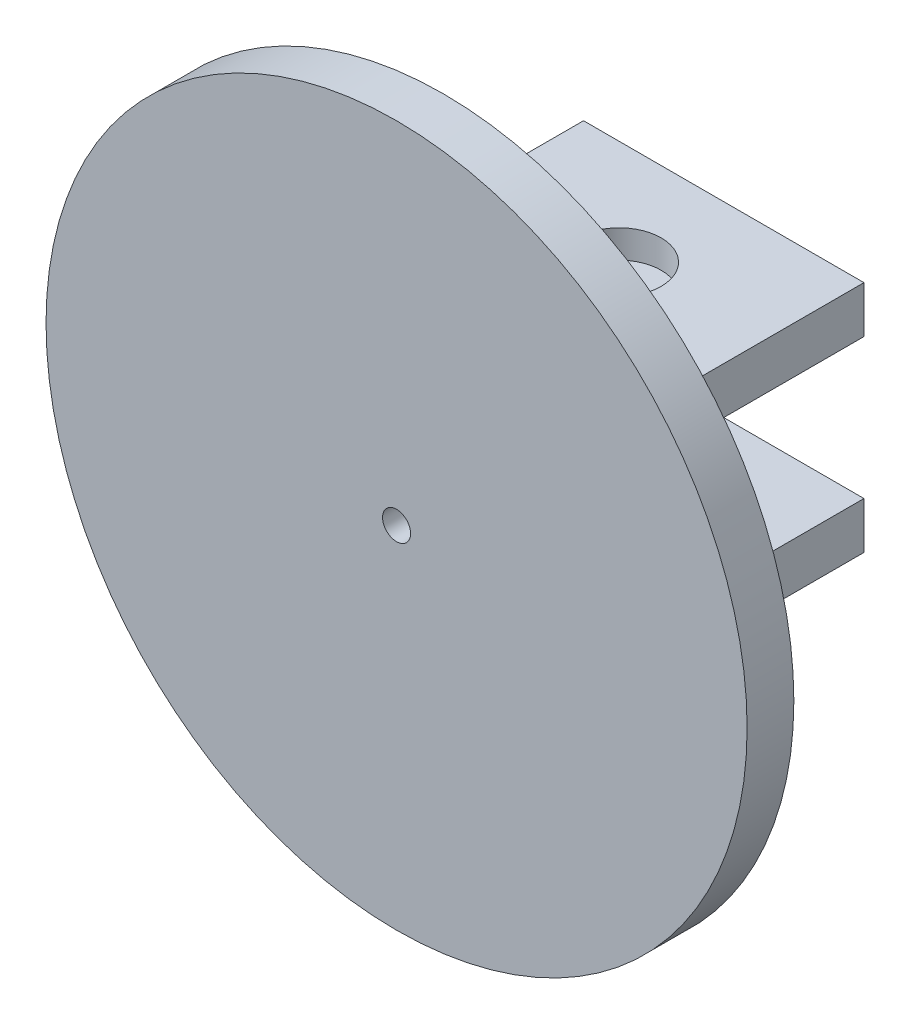
ISO-10303-21;
HEADER;
FILE_DESCRIPTION(('STEP AP214'),'2;1');
FILE_NAME('part.step','',(''),(''),'','','');
FILE_SCHEMA(('AUTOMOTIVE_DESIGN { 1 0 10303 214 1 1 1 1 }'));
ENDSEC;
DATA;
#1=APPLICATION_CONTEXT('core data for automotive mechanical design processes');
#2=APPLICATION_PROTOCOL_DEFINITION('international standard','automotive_design',2000,#1);
#3=PRODUCT_CONTEXT('',#1,'mechanical');
#4=PRODUCT('Part','Part','',(#3));
#5=PRODUCT_RELATED_PRODUCT_CATEGORY('part','',(#4));
#6=PRODUCT_DEFINITION_FORMATION('','',#4);
#7=PRODUCT_DEFINITION_CONTEXT('part definition',#1,'design');
#8=PRODUCT_DEFINITION('design','',#6,#7);
#9=PRODUCT_DEFINITION_SHAPE('','',#8);
#10=(LENGTH_UNIT() NAMED_UNIT(*) SI_UNIT(.MILLI.,.METRE.));
#11=(NAMED_UNIT(*) PLANE_ANGLE_UNIT() SI_UNIT($,.RADIAN.));
#12=(NAMED_UNIT(*) SI_UNIT($,.STERADIAN.) SOLID_ANGLE_UNIT());
#13=UNCERTAINTY_MEASURE_WITH_UNIT(LENGTH_MEASURE(1.E-05),#10,'distance_accuracy_value','');
#14=(GEOMETRIC_REPRESENTATION_CONTEXT(3) GLOBAL_UNCERTAINTY_ASSIGNED_CONTEXT((#13)) GLOBAL_UNIT_ASSIGNED_CONTEXT((#10,
#11,#12)) REPRESENTATION_CONTEXT('',''));
#15=CARTESIAN_POINT('',(0.,0.,0.));
#16=DIRECTION('',(0.,0.,1.));
#17=DIRECTION('',(1.,0.,0.));
#18=AXIS2_PLACEMENT_3D('',#15,#16,#17);
#19=CARTESIAN_POINT('',(0.,75.,-37.6));
#20=DIRECTION('',(0.,-1.,0.));
#21=DIRECTION('',(0.,0.,-1.));
#22=AXIS2_PLACEMENT_3D('',#19,#20,#21);
#23=CYLINDRICAL_SURFACE('',#22,9.);
#24=CARTESIAN_POINT('',(0.,-25.,-37.6));
#25=DIRECTION('',(0.,-1.,0.));
#26=DIRECTION('',(0.,0.,-1.));
#27=AXIS2_PLACEMENT_3D('',#24,#25,#26);
#28=CIRCLE('',#27,9.);
#29=CARTESIAN_POINT('',(0.,-25.,-46.6));
#30=VERTEX_POINT('',#29);
#31=EDGE_CURVE('E259',#30,#30,#28,.T.);
#32=ORIENTED_EDGE('',*,*,#31,.T.);
#33=EDGE_LOOP('',(#32));
#34=FACE_BOUND('',#33,.T.);
#35=CARTESIAN_POINT('',(0.,-19.,-37.6));
#36=DIRECTION('',(0.,1.,0.));
#37=DIRECTION('',(0.,0.,1.));
#38=AXIS2_PLACEMENT_3D('',#35,#36,#37);
#39=CIRCLE('',#38,9.);
#40=CARTESIAN_POINT('',(0.,-19.,-28.6));
#41=VERTEX_POINT('',#40);
#42=EDGE_CURVE('E11',#41,#41,#39,.F.);
#43=ORIENTED_EDGE('',*,*,#42,.F.);
#44=EDGE_LOOP('',(#43));
#45=FACE_BOUND('',#44,.T.);
#46=ADVANCED_FACE('F36',(#34,#45),#23,.F.);
#47=CARTESIAN_POINT('',(0.,25.,-37.6));
#48=DIRECTION('',(0.,-1.,0.));
#49=DIRECTION('',(0.,0.,-1.));
#50=AXIS2_PLACEMENT_3D('',#47,#48,#49);
#51=CIRCLE('',#50,9.);
#52=CARTESIAN_POINT('',(0.,25.,-46.6));
#53=VERTEX_POINT('',#52);
#54=EDGE_CURVE('E245',#53,#53,#51,.T.);
#55=ORIENTED_EDGE('',*,*,#54,.F.);
#56=EDGE_LOOP('',(#55));
#57=FACE_BOUND('',#56,.T.);
#58=CARTESIAN_POINT('',(0.,19.,-37.6));
#59=DIRECTION('',(0.,-1.,0.));
#60=DIRECTION('',(0.,0.,-1.));
#61=AXIS2_PLACEMENT_3D('',#58,#59,#60);
#62=CIRCLE('',#61,9.);
#63=CARTESIAN_POINT('',(0.,19.,-46.6));
#64=VERTEX_POINT('',#63);
#65=EDGE_CURVE('E44',#64,#64,#62,.F.);
#66=ORIENTED_EDGE('',*,*,#65,.F.);
#67=EDGE_LOOP('',(#66));
#68=FACE_BOUND('',#67,.T.);
#69=ADVANCED_FACE('F177',(#57,#68),#23,.F.);
#70=CARTESIAN_POINT('',(0.,0.,0.));
#71=DIRECTION('',(0.,0.,1.));
#72=DIRECTION('',(1.,0.,0.));
#73=AXIS2_PLACEMENT_3D('',#70,#71,#72);
#74=PLANE('',#73);
#75=DIRECTION('',(0.,-1.,0.));
#76=VECTOR('',#75,1.);
#77=CARTESIAN_POINT('',(30.,15.,0.));
#78=LINE('',#77,#76);
#79=CARTESIAN_POINT('',(30.,25.,0.));
#80=VERTEX_POINT('',#79);
#81=CARTESIAN_POINT('',(30.,15.,0.));
#82=VERTEX_POINT('',#81);
#83=EDGE_CURVE('E123',#80,#82,#78,.T.);
#84=ORIENTED_EDGE('',*,*,#83,.F.);
#85=DIRECTION('',(1.,0.,0.));
#86=VECTOR('',#85,1.);
#87=CARTESIAN_POINT('',(30.,25.,0.));
#88=LINE('',#87,#86);
#89=CARTESIAN_POINT('',(-30.,25.,0.));
#90=VERTEX_POINT('',#89);
#91=EDGE_CURVE('E136',#90,#80,#88,.T.);
#92=ORIENTED_EDGE('',*,*,#91,.F.);
#93=DIRECTION('',(0.,1.,0.));
#94=VECTOR('',#93,1.);
#95=CARTESIAN_POINT('',(-30.,15.,0.));
#96=LINE('',#95,#94);
#97=CARTESIAN_POINT('',(-30.,15.,0.));
#98=VERTEX_POINT('',#97);
#99=EDGE_CURVE('E145',#98,#90,#96,.T.);
#100=ORIENTED_EDGE('',*,*,#99,.F.);
#101=DIRECTION('',(-1.,0.,0.));
#102=VECTOR('',#101,1.);
#103=CARTESIAN_POINT('',(30.,15.,0.));
#104=LINE('',#103,#102);
#105=EDGE_CURVE('E126',#82,#98,#104,.T.);
#106=ORIENTED_EDGE('',*,*,#105,.F.);
#107=EDGE_LOOP('',(#84,#92,#100,#106));
#108=FACE_BOUND('',#107,.T.);
#109=CARTESIAN_POINT('',(0.,0.,0.));
#110=DIRECTION('',(0.,0.,1.));
#111=DIRECTION('',(1.,0.,0.));
#112=AXIS2_PLACEMENT_3D('',#109,#110,#111);
#113=CIRCLE('',#112,3.);
#114=CARTESIAN_POINT('',(3.,0.,0.));
#115=VERTEX_POINT('',#114);
#116=EDGE_CURVE('E164',#115,#115,#113,.F.);
#117=ORIENTED_EDGE('',*,*,#116,.F.);
#118=EDGE_LOOP('',(#117));
#119=FACE_BOUND('',#118,.T.);
#120=CARTESIAN_POINT('',(0.,0.,0.));
#121=DIRECTION('',(0.,0.,1.));
#122=DIRECTION('',(1.,0.,0.));
#123=AXIS2_PLACEMENT_3D('',#120,#121,#122);
#124=CIRCLE('',#123,75.);
#125=CARTESIAN_POINT('',(75.,0.,0.));
#126=VERTEX_POINT('',#125);
#127=EDGE_CURVE('E167',#126,#126,#124,.T.);
#128=ORIENTED_EDGE('',*,*,#127,.F.);
#129=EDGE_LOOP('',(#128));
#130=FACE_BOUND('',#129,.T.);
#131=DIRECTION('',(1.,0.,0.));
#132=VECTOR('',#131,1.);
#133=CARTESIAN_POINT('',(30.,-15.,0.));
#134=LINE('',#133,#132);
#135=CARTESIAN_POINT('',(-30.,-15.,0.));
#136=VERTEX_POINT('',#135);
#137=CARTESIAN_POINT('',(30.,-15.,0.));
#138=VERTEX_POINT('',#137);
#139=EDGE_CURVE('E122',#136,#138,#134,.T.);
#140=ORIENTED_EDGE('',*,*,#139,.F.);
#141=DIRECTION('',(0.,1.,0.));
#142=VECTOR('',#141,1.);
#143=CARTESIAN_POINT('',(-30.,-15.,0.));
#144=LINE('',#143,#142);
#145=CARTESIAN_POINT('',(-30.,-25.,0.));
#146=VERTEX_POINT('',#145);
#147=EDGE_CURVE('E118',#146,#136,#144,.T.);
#148=ORIENTED_EDGE('',*,*,#147,.F.);
#149=DIRECTION('',(-1.,0.,0.));
#150=VECTOR('',#149,1.);
#151=CARTESIAN_POINT('',(30.,-25.,0.));
#152=LINE('',#151,#150);
#153=CARTESIAN_POINT('',(30.,-25.,0.));
#154=VERTEX_POINT('',#153);
#155=EDGE_CURVE('E56',#154,#146,#152,.T.);
#156=ORIENTED_EDGE('',*,*,#155,.F.);
#157=DIRECTION('',(0.,-1.,0.));
#158=VECTOR('',#157,1.);
#159=CARTESIAN_POINT('',(30.,-15.,0.));
#160=LINE('',#159,#158);
#161=EDGE_CURVE('E51',#138,#154,#160,.T.);
#162=ORIENTED_EDGE('',*,*,#161,.F.);
#163=EDGE_LOOP('',(#140,#148,#156,#162));
#164=FACE_BOUND('',#163,.T.);
#165=ADVANCED_FACE('F179',(#108,#119,#130,#164),#74,.F.);
#166=CARTESIAN_POINT('',(0.,0.,10.));
#167=DIRECTION('',(0.,0.,-1.));
#168=DIRECTION('',(-1.,0.,0.));
#169=AXIS2_PLACEMENT_3D('',#166,#167,#168);
#170=CYLINDRICAL_SURFACE('',#169,75.);
#171=CARTESIAN_POINT('',(0.,0.,10.));
#172=DIRECTION('',(0.,0.,1.));
#173=DIRECTION('',(1.,0.,0.));
#174=AXIS2_PLACEMENT_3D('',#171,#172,#173);
#175=CIRCLE('',#174,75.);
#176=CARTESIAN_POINT('',(75.,0.,10.));
#177=VERTEX_POINT('',#176);
#178=EDGE_CURVE('E168',#177,#177,#175,.T.);
#179=ORIENTED_EDGE('',*,*,#178,.F.);
#180=EDGE_LOOP('',(#179));
#181=FACE_BOUND('',#180,.T.);
#182=ORIENTED_EDGE('',*,*,#127,.T.);
#183=EDGE_LOOP('',(#182));
#184=FACE_BOUND('',#183,.T.);
#185=ADVANCED_FACE('F38',(#181,#184),#170,.T.);
#186=CARTESIAN_POINT('',(0.,0.,10.));
#187=DIRECTION('',(0.,0.,1.));
#188=DIRECTION('',(1.,0.,0.));
#189=AXIS2_PLACEMENT_3D('',#186,#187,#188);
#190=PLANE('',#189);
#191=CARTESIAN_POINT('',(0.,0.,10.));
#192=DIRECTION('',(0.,0.,1.));
#193=DIRECTION('',(1.,0.,0.));
#194=AXIS2_PLACEMENT_3D('',#191,#192,#193);
#195=CIRCLE('',#194,3.);
#196=CARTESIAN_POINT('',(3.,0.,10.));
#197=VERTEX_POINT('',#196);
#198=EDGE_CURVE('E161',#197,#197,#195,.T.);
#199=ORIENTED_EDGE('',*,*,#198,.F.);
#200=EDGE_LOOP('',(#199));
#201=FACE_BOUND('',#200,.T.);
#202=ORIENTED_EDGE('',*,*,#178,.T.);
#203=EDGE_LOOP('',(#202));
#204=FACE_BOUND('',#203,.T.);
#205=ADVANCED_FACE('F230',(#201,#204),#190,.T.);
#206=CARTESIAN_POINT('',(0.,0.,-0.000999999999999265));
#207=DIRECTION('',(0.,0.,1.));
#208=DIRECTION('',(1.,0.,0.));
#209=AXIS2_PLACEMENT_3D('',#206,#207,#208);
#210=CYLINDRICAL_SURFACE('',#209,3.);
#211=ORIENTED_EDGE('',*,*,#198,.T.);
#212=EDGE_LOOP('',(#211));
#213=FACE_BOUND('',#212,.T.);
#214=ORIENTED_EDGE('',*,*,#116,.T.);
#215=EDGE_LOOP('',(#214));
#216=FACE_BOUND('',#215,.T.);
#217=ADVANCED_FACE('F226',(#213,#216),#210,.F.);
#218=CARTESIAN_POINT('',(30.,15.,-60.));
#219=DIRECTION('',(-1.,0.,0.));
#220=DIRECTION('',(0.,0.,1.));
#221=AXIS2_PLACEMENT_3D('',#218,#219,#220);
#222=PLANE('',#221);
#223=ORIENTED_EDGE('',*,*,#83,.T.);
#224=DIRECTION('',(0.,0.,1.));
#225=VECTOR('',#224,1.);
#226=CARTESIAN_POINT('',(30.,15.,-60.));
#227=LINE('',#226,#225);
#228=CARTESIAN_POINT('',(30.,15.,-60.));
#229=VERTEX_POINT('',#228);
#230=EDGE_CURVE('E158',#229,#82,#227,.T.);
#231=ORIENTED_EDGE('',*,*,#230,.F.);
#232=DIRECTION('',(0.,-1.,0.));
#233=VECTOR('',#232,1.);
#234=CARTESIAN_POINT('',(30.,15.,-60.));
#235=LINE('',#234,#233);
#236=CARTESIAN_POINT('',(30.,25.,-60.));
#237=VERTEX_POINT('',#236);
#238=EDGE_CURVE('E132',#237,#229,#235,.T.);
#239=ORIENTED_EDGE('',*,*,#238,.F.);
#240=DIRECTION('',(0.,0.,1.));
#241=VECTOR('',#240,1.);
#242=CARTESIAN_POINT('',(30.,25.,-60.));
#243=LINE('',#242,#241);
#244=EDGE_CURVE('E141',#237,#80,#243,.T.);
#245=ORIENTED_EDGE('',*,*,#244,.T.);
#246=EDGE_LOOP('',(#223,#231,#239,#245));
#247=FACE_BOUND('',#246,.T.);
#248=ADVANCED_FACE('F222',(#247),#222,.F.);
#249=CARTESIAN_POINT('',(30.,15.,-60.));
#250=DIRECTION('',(0.,1.,0.));
#251=DIRECTION('',(0.,0.,1.));
#252=AXIS2_PLACEMENT_3D('',#249,#250,#251);
#253=PLANE('',#252);
#254=ORIENTED_EDGE('',*,*,#105,.T.);
#255=DIRECTION('',(0.,0.,1.));
#256=VECTOR('',#255,1.);
#257=CARTESIAN_POINT('',(-30.,15.,-60.));
#258=LINE('',#257,#256);
#259=CARTESIAN_POINT('',(-30.,15.,-60.));
#260=VERTEX_POINT('',#259);
#261=EDGE_CURVE('E155',#260,#98,#258,.T.);
#262=ORIENTED_EDGE('',*,*,#261,.F.);
#263=DIRECTION('',(-1.,0.,0.));
#264=VECTOR('',#263,1.);
#265=CARTESIAN_POINT('',(30.,15.,-60.));
#266=LINE('',#265,#264);
#267=EDGE_CURVE('E135',#229,#260,#266,.T.);
#268=ORIENTED_EDGE('',*,*,#267,.F.);
#269=ORIENTED_EDGE('',*,*,#230,.T.);
#270=EDGE_LOOP('',(#254,#262,#268,#269));
#271=FACE_BOUND('',#270,.T.);
#272=CARTESIAN_POINT('',(0.,15.,-37.6));
#273=DIRECTION('',(0.,-1.,0.));
#274=DIRECTION('',(0.,0.,-1.));
#275=AXIS2_PLACEMENT_3D('',#272,#273,#274);
#276=CIRCLE('',#275,4.5);
#277=CARTESIAN_POINT('',(0.,15.,-42.1));
#278=VERTEX_POINT('',#277);
#279=EDGE_CURVE('E263',#278,#278,#276,.T.);
#280=ORIENTED_EDGE('',*,*,#279,.F.);
#281=EDGE_LOOP('',(#280));
#282=FACE_BOUND('',#281,.T.);
#283=ADVANCED_FACE('F218',(#271,#282),#253,.F.);
#284=CARTESIAN_POINT('',(-30.,15.,-60.));
#285=DIRECTION('',(1.,0.,0.));
#286=DIRECTION('',(0.,0.,-1.));
#287=AXIS2_PLACEMENT_3D('',#284,#285,#286);
#288=PLANE('',#287);
#289=ORIENTED_EDGE('',*,*,#99,.T.);
#290=DIRECTION('',(0.,0.,1.));
#291=VECTOR('',#290,1.);
#292=CARTESIAN_POINT('',(-30.,25.,-60.));
#293=LINE('',#292,#291);
#294=CARTESIAN_POINT('',(-30.,25.,-60.));
#295=VERTEX_POINT('',#294);
#296=EDGE_CURVE('E152',#295,#90,#293,.T.);
#297=ORIENTED_EDGE('',*,*,#296,.F.);
#298=DIRECTION('',(0.,1.,0.));
#299=VECTOR('',#298,1.);
#300=CARTESIAN_POINT('',(-30.,15.,-60.));
#301=LINE('',#300,#299);
#302=EDGE_CURVE('E138',#260,#295,#301,.T.);
#303=ORIENTED_EDGE('',*,*,#302,.F.);
#304=ORIENTED_EDGE('',*,*,#261,.T.);
#305=EDGE_LOOP('',(#289,#297,#303,#304));
#306=FACE_BOUND('',#305,.T.);
#307=ADVANCED_FACE('F214',(#306),#288,.F.);
#308=CARTESIAN_POINT('',(30.,25.,-60.));
#309=DIRECTION('',(0.,-1.,0.));
#310=DIRECTION('',(0.,0.,-1.));
#311=AXIS2_PLACEMENT_3D('',#308,#309,#310);
#312=PLANE('',#311);
#313=ORIENTED_EDGE('',*,*,#54,.T.);
#314=EDGE_LOOP('',(#313));
#315=FACE_BOUND('',#314,.T.);
#316=ORIENTED_EDGE('',*,*,#91,.T.);
#317=ORIENTED_EDGE('',*,*,#244,.F.);
#318=DIRECTION('',(1.,0.,0.));
#319=VECTOR('',#318,1.);
#320=CARTESIAN_POINT('',(30.,25.,-60.));
#321=LINE('',#320,#319);
#322=EDGE_CURVE('E140',#295,#237,#321,.T.);
#323=ORIENTED_EDGE('',*,*,#322,.F.);
#324=ORIENTED_EDGE('',*,*,#296,.T.);
#325=EDGE_LOOP('',(#316,#317,#323,#324));
#326=FACE_BOUND('',#325,.T.);
#327=ADVANCED_FACE('F210',(#315,#326),#312,.F.);
#328=CARTESIAN_POINT('',(0.,0.,-60.));
#329=DIRECTION('',(0.,0.,1.));
#330=DIRECTION('',(1.,0.,0.));
#331=AXIS2_PLACEMENT_3D('',#328,#329,#330);
#332=PLANE('',#331);
#333=ORIENTED_EDGE('',*,*,#238,.T.);
#334=ORIENTED_EDGE('',*,*,#267,.T.);
#335=ORIENTED_EDGE('',*,*,#302,.T.);
#336=ORIENTED_EDGE('',*,*,#322,.T.);
#337=EDGE_LOOP('',(#333,#334,#335,#336));
#338=FACE_BOUND('',#337,.T.);
#339=ADVANCED_FACE('F206',(#338),#332,.F.);
#340=CARTESIAN_POINT('',(30.,-15.,-60.));
#341=DIRECTION('',(0.,-1.,0.));
#342=DIRECTION('',(0.,0.,-1.));
#343=AXIS2_PLACEMENT_3D('',#340,#341,#342);
#344=PLANE('',#343);
#345=CARTESIAN_POINT('',(5.,-15.,-2.5));
#346=DIRECTION('',(0.,-1.,0.));
#347=DIRECTION('',(0.,0.,-1.));
#348=AXIS2_PLACEMENT_3D('',#345,#346,#347);
#349=CIRCLE('',#348,2.25);
#350=CARTESIAN_POINT('',(5.,-15.,-4.75));
#351=VERTEX_POINT('',#350);
#352=EDGE_CURVE('E272',#351,#351,#349,.T.);
#353=ORIENTED_EDGE('',*,*,#352,.T.);
#354=EDGE_LOOP('',(#353));
#355=FACE_BOUND('',#354,.T.);
#356=CARTESIAN_POINT('',(-5.,-15.,-53.));
#357=DIRECTION('',(0.,-1.,0.));
#358=DIRECTION('',(0.,0.,-1.));
#359=AXIS2_PLACEMENT_3D('',#356,#357,#358);
#360=CIRCLE('',#359,2.25);
#361=CARTESIAN_POINT('',(-5.,-15.,-55.25));
#362=VERTEX_POINT('',#361);
#363=EDGE_CURVE('E278',#362,#362,#360,.T.);
#364=ORIENTED_EDGE('',*,*,#363,.T.);
#365=EDGE_LOOP('',(#364));
#366=FACE_BOUND('',#365,.T.);
#367=CARTESIAN_POINT('',(5.28579391303517,-15.,-53.));
#368=DIRECTION('',(0.,-1.,0.));
#369=DIRECTION('',(0.,0.,-1.));
#370=AXIS2_PLACEMENT_3D('',#367,#368,#369);
#371=CIRCLE('',#370,2.25);
#372=CARTESIAN_POINT('',(5.28579391303517,-15.,-55.25));
#373=VERTEX_POINT('',#372);
#374=EDGE_CURVE('E279',#373,#373,#371,.T.);
#375=ORIENTED_EDGE('',*,*,#374,.T.);
#376=EDGE_LOOP('',(#375));
#377=FACE_BOUND('',#376,.T.);
#378=CARTESIAN_POINT('',(-5.,-15.,-2.5));
#379=DIRECTION('',(0.,-1.,0.));
#380=DIRECTION('',(0.,0.,-1.));
#381=AXIS2_PLACEMENT_3D('',#378,#379,#380);
#382=CIRCLE('',#381,2.25);
#383=CARTESIAN_POINT('',(-5.,-15.,-4.75));
#384=VERTEX_POINT('',#383);
#385=EDGE_CURVE('E266',#384,#384,#382,.T.);
#386=ORIENTED_EDGE('',*,*,#385,.T.);
#387=EDGE_LOOP('',(#386));
#388=FACE_BOUND('',#387,.T.);
#389=ORIENTED_EDGE('',*,*,#139,.T.);
#390=DIRECTION('',(0.,0.,1.));
#391=VECTOR('',#390,1.);
#392=CARTESIAN_POINT('',(30.,-15.,-60.));
#393=LINE('',#392,#391);
#394=CARTESIAN_POINT('',(30.,-15.,-60.));
#395=VERTEX_POINT('',#394);
#396=EDGE_CURVE('E102',#395,#138,#393,.T.);
#397=ORIENTED_EDGE('',*,*,#396,.F.);
#398=DIRECTION('',(1.,0.,0.));
#399=VECTOR('',#398,1.);
#400=CARTESIAN_POINT('',(30.,-15.,-60.));
#401=LINE('',#400,#399);
#402=CARTESIAN_POINT('',(-30.,-15.,-60.));
#403=VERTEX_POINT('',#402);
#404=EDGE_CURVE('E109',#403,#395,#401,.T.);
#405=ORIENTED_EDGE('',*,*,#404,.F.);
#406=DIRECTION('',(0.,0.,1.));
#407=VECTOR('',#406,1.);
#408=CARTESIAN_POINT('',(-30.,-15.,-60.));
#409=LINE('',#408,#407);
#410=EDGE_CURVE('E248',#403,#136,#409,.T.);
#411=ORIENTED_EDGE('',*,*,#410,.T.);
#412=EDGE_LOOP('',(#389,#397,#405,#411));
#413=FACE_BOUND('',#412,.T.);
#414=CARTESIAN_POINT('',(0.,-15.,-37.6));
#415=DIRECTION('',(0.,-1.,0.));
#416=DIRECTION('',(0.,0.,-1.));
#417=AXIS2_PLACEMENT_3D('',#414,#415,#416);
#418=CIRCLE('',#417,4.5);
#419=CARTESIAN_POINT('',(0.,-15.,-42.1));
#420=VERTEX_POINT('',#419);
#421=EDGE_CURVE('E293',#420,#420,#418,.T.);
#422=ORIENTED_EDGE('',*,*,#421,.T.);
#423=EDGE_LOOP('',(#422));
#424=FACE_BOUND('',#423,.T.);
#425=ADVANCED_FACE('F120',(#355,#366,#377,#388,#413,#424),#344,.F.);
#426=CARTESIAN_POINT('',(30.,-15.,-60.));
#427=DIRECTION('',(-1.,0.,0.));
#428=DIRECTION('',(0.,0.,1.));
#429=AXIS2_PLACEMENT_3D('',#426,#427,#428);
#430=PLANE('',#429);
#431=ORIENTED_EDGE('',*,*,#161,.T.);
#432=DIRECTION('',(0.,0.,1.));
#433=VECTOR('',#432,1.);
#434=CARTESIAN_POINT('',(30.,-25.,-60.));
#435=LINE('',#434,#433);
#436=CARTESIAN_POINT('',(30.,-25.,-60.));
#437=VERTEX_POINT('',#436);
#438=EDGE_CURVE('E105',#437,#154,#435,.T.);
#439=ORIENTED_EDGE('',*,*,#438,.F.);
#440=DIRECTION('',(0.,-1.,0.));
#441=VECTOR('',#440,1.);
#442=CARTESIAN_POINT('',(30.,-15.,-60.));
#443=LINE('',#442,#441);
#444=EDGE_CURVE('E98',#395,#437,#443,.T.);
#445=ORIENTED_EDGE('',*,*,#444,.F.);
#446=ORIENTED_EDGE('',*,*,#396,.T.);
#447=EDGE_LOOP('',(#431,#439,#445,#446));
#448=FACE_BOUND('',#447,.T.);
#449=ADVANCED_FACE('F100',(#448),#430,.F.);
#450=CARTESIAN_POINT('',(30.,-25.,-60.));
#451=DIRECTION('',(0.,1.,0.));
#452=DIRECTION('',(0.,0.,1.));
#453=AXIS2_PLACEMENT_3D('',#450,#451,#452);
#454=PLANE('',#453);
#455=CARTESIAN_POINT('',(5.,-25.,-2.5));
#456=DIRECTION('',(0.,-1.,0.));
#457=DIRECTION('',(0.,0.,-1.));
#458=AXIS2_PLACEMENT_3D('',#455,#456,#457);
#459=CIRCLE('',#458,2.25);
#460=CARTESIAN_POINT('',(5.,-25.,-4.75));
#461=VERTEX_POINT('',#460);
#462=EDGE_CURVE('E282',#461,#461,#459,.T.);
#463=ORIENTED_EDGE('',*,*,#462,.F.);
#464=EDGE_LOOP('',(#463));
#465=FACE_BOUND('',#464,.T.);
#466=CARTESIAN_POINT('',(-5.,-25.,-53.));
#467=DIRECTION('',(0.,-1.,0.));
#468=DIRECTION('',(0.,0.,-1.));
#469=AXIS2_PLACEMENT_3D('',#466,#467,#468);
#470=CIRCLE('',#469,2.25);
#471=CARTESIAN_POINT('',(-5.,-25.,-55.25));
#472=VERTEX_POINT('',#471);
#473=EDGE_CURVE('E275',#472,#472,#470,.T.);
#474=ORIENTED_EDGE('',*,*,#473,.F.);
#475=EDGE_LOOP('',(#474));
#476=FACE_BOUND('',#475,.T.);
#477=CARTESIAN_POINT('',(5.28579391303517,-25.,-53.));
#478=DIRECTION('',(0.,-1.,0.));
#479=DIRECTION('',(0.,0.,-1.));
#480=AXIS2_PLACEMENT_3D('',#477,#478,#479);
#481=CIRCLE('',#480,2.25);
#482=CARTESIAN_POINT('',(5.28579391303517,-25.,-55.25));
#483=VERTEX_POINT('',#482);
#484=EDGE_CURVE('E287',#483,#483,#481,.T.);
#485=ORIENTED_EDGE('',*,*,#484,.F.);
#486=EDGE_LOOP('',(#485));
#487=FACE_BOUND('',#486,.T.);
#488=CARTESIAN_POINT('',(-5.,-25.,-2.5));
#489=DIRECTION('',(0.,-1.,0.));
#490=DIRECTION('',(0.,0.,-1.));
#491=AXIS2_PLACEMENT_3D('',#488,#489,#490);
#492=CIRCLE('',#491,2.25);
#493=CARTESIAN_POINT('',(-5.,-25.,-4.75));
#494=VERTEX_POINT('',#493);
#495=EDGE_CURVE('E269',#494,#494,#492,.T.);
#496=ORIENTED_EDGE('',*,*,#495,.F.);
#497=EDGE_LOOP('',(#496));
#498=FACE_BOUND('',#497,.T.);
#499=ORIENTED_EDGE('',*,*,#31,.F.);
#500=EDGE_LOOP('',(#499));
#501=FACE_BOUND('',#500,.T.);
#502=ORIENTED_EDGE('',*,*,#155,.T.);
#503=DIRECTION('',(0.,0.,1.));
#504=VECTOR('',#503,1.);
#505=CARTESIAN_POINT('',(-30.,-25.,-60.));
#506=LINE('',#505,#504);
#507=CARTESIAN_POINT('',(-30.,-25.,-60.));
#508=VERTEX_POINT('',#507);
#509=EDGE_CURVE('E128',#508,#146,#506,.T.);
#510=ORIENTED_EDGE('',*,*,#509,.F.);
#511=DIRECTION('',(-1.,0.,0.));
#512=VECTOR('',#511,1.);
#513=CARTESIAN_POINT('',(30.,-25.,-60.));
#514=LINE('',#513,#512);
#515=EDGE_CURVE('E108',#437,#508,#514,.T.);
#516=ORIENTED_EDGE('',*,*,#515,.F.);
#517=ORIENTED_EDGE('',*,*,#438,.T.);
#518=EDGE_LOOP('',(#502,#510,#516,#517));
#519=FACE_BOUND('',#518,.T.);
#520=ADVANCED_FACE('F197',(#465,#476,#487,#498,#501,#519),#454,.F.);
#521=CARTESIAN_POINT('',(-30.,-15.,-60.));
#522=DIRECTION('',(1.,0.,0.));
#523=DIRECTION('',(0.,0.,-1.));
#524=AXIS2_PLACEMENT_3D('',#521,#522,#523);
#525=PLANE('',#524);
#526=ORIENTED_EDGE('',*,*,#147,.T.);
#527=ORIENTED_EDGE('',*,*,#410,.F.);
#528=DIRECTION('',(0.,1.,0.));
#529=VECTOR('',#528,1.);
#530=CARTESIAN_POINT('',(-30.,-15.,-60.));
#531=LINE('',#530,#529);
#532=EDGE_CURVE('E114',#508,#403,#531,.T.);
#533=ORIENTED_EDGE('',*,*,#532,.F.);
#534=ORIENTED_EDGE('',*,*,#509,.T.);
#535=EDGE_LOOP('',(#526,#527,#533,#534));
#536=FACE_BOUND('',#535,.T.);
#537=ADVANCED_FACE('F194',(#536),#525,.F.);
#538=CARTESIAN_POINT('',(0.,0.,-60.));
#539=DIRECTION('',(0.,0.,1.));
#540=DIRECTION('',(1.,0.,0.));
#541=AXIS2_PLACEMENT_3D('',#538,#539,#540);
#542=PLANE('',#541);
#543=ORIENTED_EDGE('',*,*,#404,.T.);
#544=ORIENTED_EDGE('',*,*,#444,.T.);
#545=ORIENTED_EDGE('',*,*,#515,.T.);
#546=ORIENTED_EDGE('',*,*,#532,.T.);
#547=EDGE_LOOP('',(#543,#544,#545,#546));
#548=FACE_BOUND('',#547,.T.);
#549=ADVANCED_FACE('F112',(#548),#542,.F.);
#550=CARTESIAN_POINT('',(0.,19.,-37.6));
#551=DIRECTION('',(0.,-1.,0.));
#552=DIRECTION('',(0.,0.,-1.));
#553=AXIS2_PLACEMENT_3D('',#550,#551,#552);
#554=PLANE('',#553);
#555=CARTESIAN_POINT('',(0.,19.,-37.6));
#556=DIRECTION('',(0.,-1.,0.));
#557=DIRECTION('',(0.,0.,-1.));
#558=AXIS2_PLACEMENT_3D('',#555,#556,#557);
#559=CIRCLE('',#558,4.5);
#560=CARTESIAN_POINT('',(0.,19.,-42.1));
#561=VERTEX_POINT('',#560);
#562=EDGE_CURVE('E262',#561,#561,#559,.T.);
#563=ORIENTED_EDGE('',*,*,#562,.T.);
#564=EDGE_LOOP('',(#563));
#565=FACE_BOUND('',#564,.T.);
#566=ORIENTED_EDGE('',*,*,#65,.T.);
#567=EDGE_LOOP('',(#566));
#568=FACE_BOUND('',#567,.T.);
#569=ADVANCED_FACE('F175',(#565,#568),#554,.F.);
#570=CARTESIAN_POINT('',(0.,19.,-37.6));
#571=DIRECTION('',(0.,-1.,0.));
#572=DIRECTION('',(0.,0.,-1.));
#573=AXIS2_PLACEMENT_3D('',#570,#571,#572);
#574=CYLINDRICAL_SURFACE('',#573,4.5);
#575=ORIENTED_EDGE('',*,*,#562,.F.);
#576=EDGE_LOOP('',(#575));
#577=FACE_BOUND('',#576,.T.);
#578=ORIENTED_EDGE('',*,*,#279,.T.);
#579=EDGE_LOOP('',(#578));
#580=FACE_BOUND('',#579,.T.);
#581=ADVANCED_FACE('F325',(#577,#580),#574,.F.);
#582=CARTESIAN_POINT('',(-5.,-15.,-2.5));
#583=DIRECTION('',(0.,-1.,0.));
#584=DIRECTION('',(0.,0.,-1.));
#585=AXIS2_PLACEMENT_3D('',#582,#583,#584);
#586=CYLINDRICAL_SURFACE('',#585,2.25);
#587=ORIENTED_EDGE('',*,*,#385,.F.);
#588=EDGE_LOOP('',(#587));
#589=FACE_BOUND('',#588,.T.);
#590=ORIENTED_EDGE('',*,*,#495,.T.);
#591=EDGE_LOOP('',(#590));
#592=FACE_BOUND('',#591,.T.);
#593=ADVANCED_FACE('F318',(#589,#592),#586,.F.);
#594=CARTESIAN_POINT('',(5.28579391303517,-15.,-53.));
#595=DIRECTION('',(0.,-1.,0.));
#596=DIRECTION('',(0.,0.,-1.));
#597=AXIS2_PLACEMENT_3D('',#594,#595,#596);
#598=CYLINDRICAL_SURFACE('',#597,2.25);
#599=ORIENTED_EDGE('',*,*,#374,.F.);
#600=EDGE_LOOP('',(#599));
#601=FACE_BOUND('',#600,.T.);
#602=ORIENTED_EDGE('',*,*,#484,.T.);
#603=EDGE_LOOP('',(#602));
#604=FACE_BOUND('',#603,.T.);
#605=ADVANCED_FACE('F316',(#601,#604),#598,.F.);
#606=CARTESIAN_POINT('',(-5.,-15.,-53.));
#607=DIRECTION('',(0.,-1.,0.));
#608=DIRECTION('',(0.,0.,-1.));
#609=AXIS2_PLACEMENT_3D('',#606,#607,#608);
#610=CYLINDRICAL_SURFACE('',#609,2.25);
#611=ORIENTED_EDGE('',*,*,#363,.F.);
#612=EDGE_LOOP('',(#611));
#613=FACE_BOUND('',#612,.T.);
#614=ORIENTED_EDGE('',*,*,#473,.T.);
#615=EDGE_LOOP('',(#614));
#616=FACE_BOUND('',#615,.T.);
#617=ADVANCED_FACE('F312',(#613,#616),#610,.F.);
#618=CARTESIAN_POINT('',(5.,-15.,-2.5));
#619=DIRECTION('',(0.,-1.,0.));
#620=DIRECTION('',(0.,0.,-1.));
#621=AXIS2_PLACEMENT_3D('',#618,#619,#620);
#622=CYLINDRICAL_SURFACE('',#621,2.25);
#623=ORIENTED_EDGE('',*,*,#352,.F.);
#624=EDGE_LOOP('',(#623));
#625=FACE_BOUND('',#624,.T.);
#626=ORIENTED_EDGE('',*,*,#462,.T.);
#627=EDGE_LOOP('',(#626));
#628=FACE_BOUND('',#627,.T.);
#629=ADVANCED_FACE('F304',(#625,#628),#622,.F.);
#630=CARTESIAN_POINT('',(0.,-19.,-37.6));
#631=DIRECTION('',(0.,1.,0.));
#632=DIRECTION('',(0.,0.,-1.));
#633=AXIS2_PLACEMENT_3D('',#630,#631,#632);
#634=PLANE('',#633);
#635=ORIENTED_EDGE('',*,*,#42,.T.);
#636=EDGE_LOOP('',(#635));
#637=FACE_BOUND('',#636,.T.);
#638=CARTESIAN_POINT('',(0.,-19.,-37.6));
#639=DIRECTION('',(0.,-1.,0.));
#640=DIRECTION('',(0.,0.,-1.));
#641=AXIS2_PLACEMENT_3D('',#638,#639,#640);
#642=CIRCLE('',#641,4.5);
#643=CARTESIAN_POINT('',(0.,-19.,-42.1));
#644=VERTEX_POINT('',#643);
#645=EDGE_CURVE('E290',#644,#644,#642,.T.);
#646=ORIENTED_EDGE('',*,*,#645,.F.);
#647=EDGE_LOOP('',(#646));
#648=FACE_BOUND('',#647,.T.);
#649=ADVANCED_FACE('F302',(#637,#648),#634,.F.);
#650=CARTESIAN_POINT('',(0.,-19.,-37.6));
#651=DIRECTION('',(0.,1.,0.));
#652=DIRECTION('',(0.,0.,1.));
#653=AXIS2_PLACEMENT_3D('',#650,#651,#652);
#654=CYLINDRICAL_SURFACE('',#653,4.5);
#655=ORIENTED_EDGE('',*,*,#645,.T.);
#656=EDGE_LOOP('',(#655));
#657=FACE_BOUND('',#656,.T.);
#658=ORIENTED_EDGE('',*,*,#421,.F.);
#659=EDGE_LOOP('',(#658));
#660=FACE_BOUND('',#659,.T.);
#661=ADVANCED_FACE('F299',(#657,#660),#654,.F.);
#662=CLOSED_SHELL('',(#46,#69,#165,#185,#205,#217,#248,#283,#307,#327,#339,#425,#449,#520,#537,
#549,#569,#581,#593,#605,#617,#629,#649,#661));
#663=MANIFOLD_SOLID_BREP('B2',#662);
#664=ADVANCED_BREP_SHAPE_REPRESENTATION('',(#18,#663),#14);
#665=SHAPE_DEFINITION_REPRESENTATION(#9,#664);
ENDSEC;
END-ISO-10303-21;
